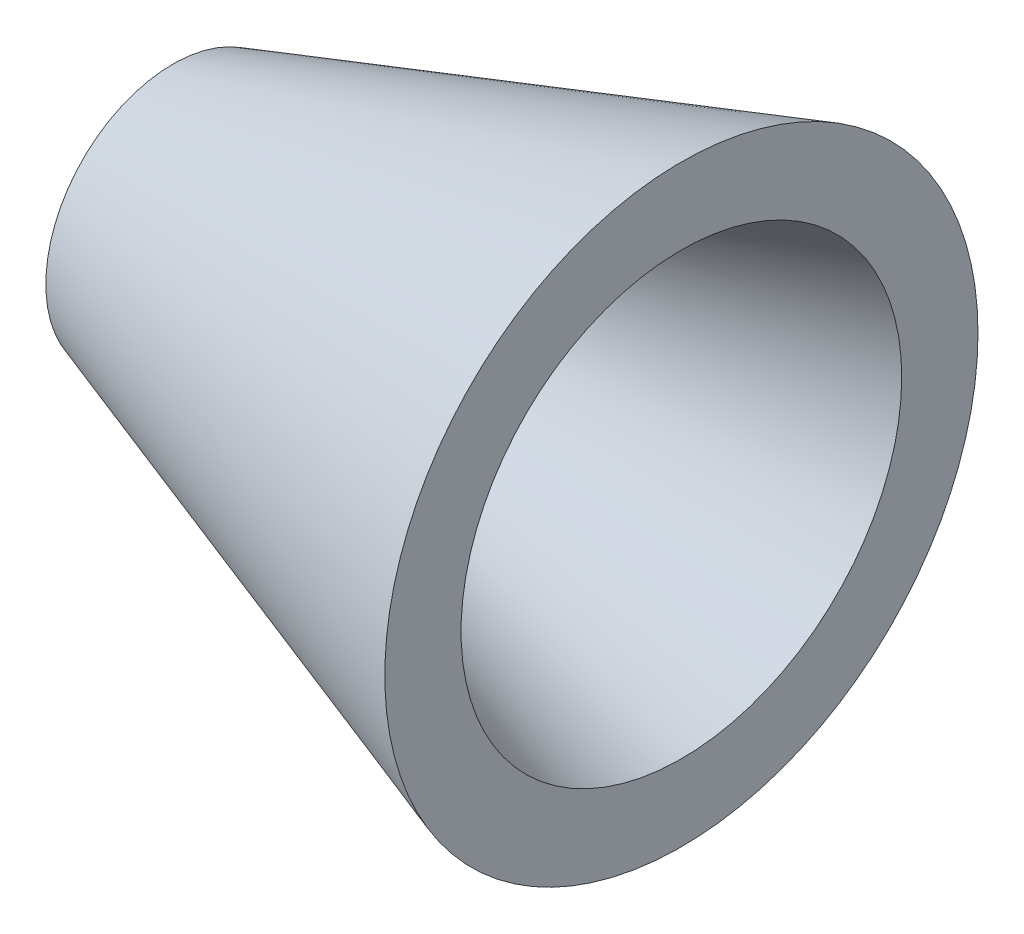
ISO-10303-21;
HEADER;
FILE_DESCRIPTION(('STEP AP214'),'2;1');
FILE_NAME('part.step','',(''),(''),'','','');
FILE_SCHEMA(('AUTOMOTIVE_DESIGN { 1 0 10303 214 1 1 1 1 }'));
ENDSEC;
DATA;
#1=APPLICATION_CONTEXT('core data for automotive mechanical design processes');
#2=APPLICATION_PROTOCOL_DEFINITION('international standard','automotive_design',2000,#1);
#3=PRODUCT_CONTEXT('',#1,'mechanical');
#4=PRODUCT('Part','Part','',(#3));
#5=PRODUCT_RELATED_PRODUCT_CATEGORY('part','',(#4));
#6=PRODUCT_DEFINITION_FORMATION('','',#4);
#7=PRODUCT_DEFINITION_CONTEXT('part definition',#1,'design');
#8=PRODUCT_DEFINITION('design','',#6,#7);
#9=PRODUCT_DEFINITION_SHAPE('','',#8);
#10=(LENGTH_UNIT() NAMED_UNIT(*) SI_UNIT(.MILLI.,.METRE.));
#11=(NAMED_UNIT(*) PLANE_ANGLE_UNIT() SI_UNIT($,.RADIAN.));
#12=(NAMED_UNIT(*) SI_UNIT($,.STERADIAN.) SOLID_ANGLE_UNIT());
#13=UNCERTAINTY_MEASURE_WITH_UNIT(LENGTH_MEASURE(1.E-05),#10,'distance_accuracy_value','');
#14=(GEOMETRIC_REPRESENTATION_CONTEXT(3) GLOBAL_UNCERTAINTY_ASSIGNED_CONTEXT((#13)) GLOBAL_UNIT_ASSIGNED_CONTEXT((#10,
#11,#12)) REPRESENTATION_CONTEXT('',''));
#15=CARTESIAN_POINT('',(0.,0.,0.));
#16=DIRECTION('',(0.,0.,1.));
#17=DIRECTION('',(1.,0.,0.));
#18=AXIS2_PLACEMENT_3D('',#15,#16,#17);
#19=CARTESIAN_POINT('',(-140.,60.,0.));
#20=DIRECTION('',(1.,0.,0.));
#21=DIRECTION('',(0.,0.,-1.));
#22=AXIS2_PLACEMENT_3D('',#19,#20,#21);
#23=PLANE('',#22);
#24=CARTESIAN_POINT('',(-140.,0.,0.));
#25=DIRECTION('',(1.,0.,0.));
#26=DIRECTION('',(0.,0.,-1.));
#27=AXIS2_PLACEMENT_3D('',#24,#25,#26);
#28=CIRCLE('',#27,60.);
#29=CARTESIAN_POINT('',(-140.,0.,-60.));
#30=VERTEX_POINT('',#29);
#31=EDGE_CURVE('E54',#30,#30,#28,.T.);
#32=ORIENTED_EDGE('',*,*,#31,.T.);
#33=EDGE_LOOP('',(#32));
#34=FACE_BOUND('',#33,.T.);
#35=ADVANCED_FACE('F37',(#34),#23,.T.);
#36=CARTESIAN_POINT('',(-200.,0.,0.));
#37=DIRECTION('',(-1.,0.,0.));
#38=DIRECTION('',(0.,0.,1.));
#39=AXIS2_PLACEMENT_3D('',#36,#37,#38);
#40=PLANE('',#39);
#41=CARTESIAN_POINT('',(-200.,0.,0.));
#42=DIRECTION('',(1.,0.,0.));
#43=DIRECTION('',(0.,0.,-1.));
#44=AXIS2_PLACEMENT_3D('',#41,#42,#43);
#45=CIRCLE('',#44,100.);
#46=CARTESIAN_POINT('',(-200.,0.,-100.));
#47=VERTEX_POINT('',#46);
#48=EDGE_CURVE('E10',#47,#47,#45,.T.);
#49=ORIENTED_EDGE('',*,*,#48,.F.);
#50=EDGE_LOOP('',(#49));
#51=FACE_BOUND('',#50,.T.);
#52=ADVANCED_FACE('F73',(#51),#40,.T.);
#53=CARTESIAN_POINT('',(200.,0.,0.));
#54=DIRECTION('',(1.,0.,0.));
#55=DIRECTION('',(0.,0.,-1.));
#56=AXIS2_PLACEMENT_3D('',#53,#54,#55);
#57=CONICAL_SURFACE('',#56,233.333333333333,0.321750554396642);
#58=ORIENTED_EDGE('',*,*,#48,.T.);
#59=EDGE_LOOP('',(#58));
#60=FACE_BOUND('',#59,.T.);
#61=CARTESIAN_POINT('',(200.,0.,0.));
#62=DIRECTION('',(1.,0.,0.));
#63=DIRECTION('',(0.,0.,-1.));
#64=AXIS2_PLACEMENT_3D('',#61,#62,#63);
#65=CIRCLE('',#64,233.333333333333);
#66=CARTESIAN_POINT('',(200.,0.,-233.333333333333));
#67=VERTEX_POINT('',#66);
#68=EDGE_CURVE('E44',#67,#67,#65,.T.);
#69=ORIENTED_EDGE('',*,*,#68,.F.);
#70=EDGE_LOOP('',(#69));
#71=FACE_BOUND('',#70,.T.);
#72=ADVANCED_FACE('F70',(#60,#71),#57,.T.);
#73=CARTESIAN_POINT('',(200.,233.333333333333,0.));
#74=DIRECTION('',(1.,0.,0.));
#75=DIRECTION('',(0.,0.,-1.));
#76=AXIS2_PLACEMENT_3D('',#73,#74,#75);
#77=PLANE('',#76);
#78=ORIENTED_EDGE('',*,*,#68,.T.);
#79=EDGE_LOOP('',(#78));
#80=FACE_BOUND('',#79,.T.);
#81=CARTESIAN_POINT('',(200.,0.,0.));
#82=DIRECTION('',(1.,0.,0.));
#83=DIRECTION('',(0.,0.,-1.));
#84=AXIS2_PLACEMENT_3D('',#81,#82,#83);
#85=CIRCLE('',#84,173.333333333333);
#86=CARTESIAN_POINT('',(200.,0.,-173.333333333333));
#87=VERTEX_POINT('',#86);
#88=EDGE_CURVE('E49',#87,#87,#85,.T.);
#89=ORIENTED_EDGE('',*,*,#88,.F.);
#90=EDGE_LOOP('',(#89));
#91=FACE_BOUND('',#90,.T.);
#92=ADVANCED_FACE('F64',(#80,#91),#77,.T.);
#93=CARTESIAN_POINT('',(-140.,0.,0.));
#94=DIRECTION('',(1.,0.,0.));
#95=DIRECTION('',(0.,0.,-1.));
#96=AXIS2_PLACEMENT_3D('',#93,#94,#95);
#97=CONICAL_SURFACE('',#96,60.,0.321750554396642);
#98=ORIENTED_EDGE('',*,*,#88,.T.);
#99=EDGE_LOOP('',(#98));
#100=FACE_BOUND('',#99,.T.);
#101=ORIENTED_EDGE('',*,*,#31,.F.);
#102=EDGE_LOOP('',(#101));
#103=FACE_BOUND('',#102,.T.);
#104=ADVANCED_FACE('F62',(#100,#103),#97,.F.);
#105=CLOSED_SHELL('',(#35,#52,#72,#92,#104));
#106=MANIFOLD_SOLID_BREP('B2',#105);
#107=ADVANCED_BREP_SHAPE_REPRESENTATION('',(#18,#106),#14);
#108=SHAPE_DEFINITION_REPRESENTATION(#9,#107);
ENDSEC;
END-ISO-10303-21;
